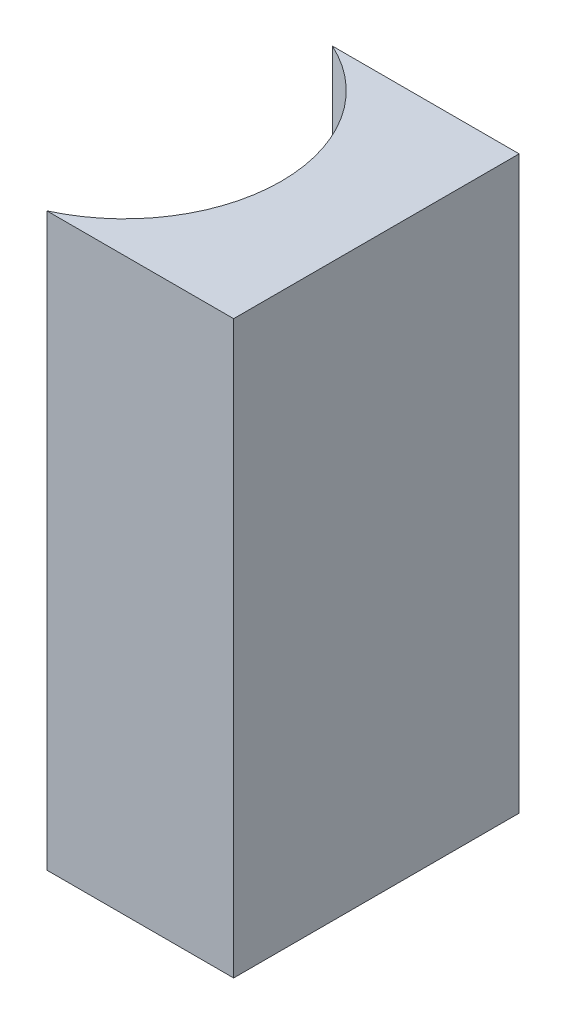
ISO-10303-21;
HEADER;
FILE_DESCRIPTION(('STEP AP214'),'2;1');
FILE_NAME('part.step','',(''),(''),'','','');
FILE_SCHEMA(('AUTOMOTIVE_DESIGN { 1 0 10303 214 1 1 1 1 }'));
ENDSEC;
DATA;
#1=APPLICATION_CONTEXT('core data for automotive mechanical design processes');
#2=APPLICATION_PROTOCOL_DEFINITION('international standard','automotive_design',2000,#1);
#3=PRODUCT_CONTEXT('',#1,'mechanical');
#4=PRODUCT('Part','Part','',(#3));
#5=PRODUCT_RELATED_PRODUCT_CATEGORY('part','',(#4));
#6=PRODUCT_DEFINITION_FORMATION('','',#4);
#7=PRODUCT_DEFINITION_CONTEXT('part definition',#1,'design');
#8=PRODUCT_DEFINITION('design','',#6,#7);
#9=PRODUCT_DEFINITION_SHAPE('','',#8);
#10=(LENGTH_UNIT() NAMED_UNIT(*) SI_UNIT(.MILLI.,.METRE.));
#11=(NAMED_UNIT(*) PLANE_ANGLE_UNIT() SI_UNIT($,.RADIAN.));
#12=(NAMED_UNIT(*) SI_UNIT($,.STERADIAN.) SOLID_ANGLE_UNIT());
#13=UNCERTAINTY_MEASURE_WITH_UNIT(LENGTH_MEASURE(1.E-05),#10,'distance_accuracy_value','');
#14=(GEOMETRIC_REPRESENTATION_CONTEXT(3) GLOBAL_UNCERTAINTY_ASSIGNED_CONTEXT((#13)) GLOBAL_UNIT_ASSIGNED_CONTEXT((#10,
#11,#12)) REPRESENTATION_CONTEXT('',''));
#15=CARTESIAN_POINT('',(0.,0.,0.));
#16=DIRECTION('',(0.,0.,1.));
#17=DIRECTION('',(1.,0.,0.));
#18=AXIS2_PLACEMENT_3D('',#15,#16,#17);
#19=CARTESIAN_POINT('',(0.,12.,0.));
#20=DIRECTION('',(0.,0.,1.));
#21=DIRECTION('',(1.,0.,0.));
#22=AXIS2_PLACEMENT_3D('',#19,#20,#21);
#23=PLANE('',#22);
#24=DIRECTION('',(-1.,0.,0.));
#25=VECTOR('',#24,1.);
#26=CARTESIAN_POINT('',(0.,0.,0.));
#27=LINE('',#26,#25);
#28=CARTESIAN_POINT('',(0.,0.,0.));
#29=VERTEX_POINT('',#28);
#30=CARTESIAN_POINT('',(-3.92522729151325,0.,0.));
#31=VERTEX_POINT('',#30);
#32=EDGE_CURVE('E109',#29,#31,#27,.T.);
#33=ORIENTED_EDGE('',*,*,#32,.T.);
#34=DIRECTION('',(0.,-1.,0.));
#35=VECTOR('',#34,1.);
#36=CARTESIAN_POINT('',(-3.92522729151325,12.,0.));
#37=LINE('',#36,#35);
#38=CARTESIAN_POINT('',(-3.92522729151325,12.,0.));
#39=VERTEX_POINT('',#38);
#40=EDGE_CURVE('E11',#39,#31,#37,.T.);
#41=ORIENTED_EDGE('',*,*,#40,.F.);
#42=DIRECTION('',(-1.,0.,0.));
#43=VECTOR('',#42,1.);
#44=CARTESIAN_POINT('',(0.,12.,0.));
#45=LINE('',#44,#43);
#46=CARTESIAN_POINT('',(0.,12.,0.));
#47=VERTEX_POINT('',#46);
#48=EDGE_CURVE('E91',#47,#39,#45,.T.);
#49=ORIENTED_EDGE('',*,*,#48,.F.);
#50=DIRECTION('',(0.,-1.,0.));
#51=VECTOR('',#50,1.);
#52=CARTESIAN_POINT('',(0.,12.,0.));
#53=LINE('',#52,#51);
#54=EDGE_CURVE('E105',#47,#29,#53,.T.);
#55=ORIENTED_EDGE('',*,*,#54,.T.);
#56=EDGE_LOOP('',(#33,#41,#49,#55));
#57=FACE_BOUND('',#56,.T.);
#58=ADVANCED_FACE('F39',(#57),#23,.F.);
#59=CARTESIAN_POINT('',(-5.3,12.,3.));
#60=DIRECTION('',(0.,-1.,0.));
#61=DIRECTION('',(0.,0.,-1.));
#62=AXIS2_PLACEMENT_3D('',#59,#60,#61);
#63=CYLINDRICAL_SURFACE('',#62,3.3);
#64=CARTESIAN_POINT('',(-5.3,0.,3.));
#65=DIRECTION('',(0.,-1.,0.));
#66=DIRECTION('',(0.,0.,1.));
#67=AXIS2_PLACEMENT_3D('',#64,#65,#66);
#68=CIRCLE('',#67,3.3);
#69=CARTESIAN_POINT('',(-3.92522729151325,0.,6.));
#70=VERTEX_POINT('',#69);
#71=EDGE_CURVE('E96',#31,#70,#68,.T.);
#72=ORIENTED_EDGE('',*,*,#71,.T.);
#73=DIRECTION('',(0.,-1.,0.));
#74=VECTOR('',#73,1.);
#75=CARTESIAN_POINT('',(-3.92522729151325,12.,6.));
#76=LINE('',#75,#74);
#77=CARTESIAN_POINT('',(-3.92522729151325,12.,6.));
#78=VERTEX_POINT('',#77);
#79=EDGE_CURVE('E48',#78,#70,#76,.T.);
#80=ORIENTED_EDGE('',*,*,#79,.F.);
#81=CARTESIAN_POINT('',(-5.3,12.,3.));
#82=DIRECTION('',(0.,-1.,0.));
#83=DIRECTION('',(0.,0.,1.));
#84=AXIS2_PLACEMENT_3D('',#81,#82,#83);
#85=CIRCLE('',#84,3.3);
#86=EDGE_CURVE('E86',#39,#78,#85,.T.);
#87=ORIENTED_EDGE('',*,*,#86,.F.);
#88=ORIENTED_EDGE('',*,*,#40,.T.);
#89=EDGE_LOOP('',(#72,#80,#87,#88));
#90=FACE_BOUND('',#89,.T.);
#91=ADVANCED_FACE('F95',(#90),#63,.F.);
#92=CARTESIAN_POINT('',(0.,12.,6.));
#93=DIRECTION('',(0.,0.,-1.));
#94=DIRECTION('',(-1.,0.,0.));
#95=AXIS2_PLACEMENT_3D('',#92,#93,#94);
#96=PLANE('',#95);
#97=DIRECTION('',(1.,0.,0.));
#98=VECTOR('',#97,1.);
#99=CARTESIAN_POINT('',(0.,0.,6.));
#100=LINE('',#99,#98);
#101=CARTESIAN_POINT('',(0.,0.,6.));
#102=VERTEX_POINT('',#101);
#103=EDGE_CURVE('E73',#70,#102,#100,.T.);
#104=ORIENTED_EDGE('',*,*,#103,.T.);
#105=DIRECTION('',(0.,-1.,0.));
#106=VECTOR('',#105,1.);
#107=CARTESIAN_POINT('',(0.,12.,6.));
#108=LINE('',#107,#106);
#109=CARTESIAN_POINT('',(0.,12.,6.));
#110=VERTEX_POINT('',#109);
#111=EDGE_CURVE('E98',#110,#102,#108,.T.);
#112=ORIENTED_EDGE('',*,*,#111,.F.);
#113=DIRECTION('',(1.,0.,0.));
#114=VECTOR('',#113,1.);
#115=CARTESIAN_POINT('',(0.,12.,6.));
#116=LINE('',#115,#114);
#117=EDGE_CURVE('E89',#78,#110,#116,.T.);
#118=ORIENTED_EDGE('',*,*,#117,.F.);
#119=ORIENTED_EDGE('',*,*,#79,.T.);
#120=EDGE_LOOP('',(#104,#112,#118,#119));
#121=FACE_BOUND('',#120,.T.);
#122=ADVANCED_FACE('F99',(#121),#96,.F.);
#123=CARTESIAN_POINT('',(0.,12.,0.));
#124=DIRECTION('',(-1.,0.,0.));
#125=DIRECTION('',(0.,0.,1.));
#126=AXIS2_PLACEMENT_3D('',#123,#124,#125);
#127=PLANE('',#126);
#128=DIRECTION('',(0.,0.,-1.));
#129=VECTOR('',#128,1.);
#130=CARTESIAN_POINT('',(0.,0.,0.));
#131=LINE('',#130,#129);
#132=EDGE_CURVE('E79',#102,#29,#131,.T.);
#133=ORIENTED_EDGE('',*,*,#132,.T.);
#134=ORIENTED_EDGE('',*,*,#54,.F.);
#135=DIRECTION('',(0.,0.,-1.));
#136=VECTOR('',#135,1.);
#137=CARTESIAN_POINT('',(0.,12.,0.));
#138=LINE('',#137,#136);
#139=EDGE_CURVE('E56',#110,#47,#138,.T.);
#140=ORIENTED_EDGE('',*,*,#139,.F.);
#141=ORIENTED_EDGE('',*,*,#111,.T.);
#142=EDGE_LOOP('',(#133,#134,#140,#141));
#143=FACE_BOUND('',#142,.T.);
#144=ADVANCED_FACE('F120',(#143),#127,.F.);
#145=CARTESIAN_POINT('',(-5.3,12.,3.));
#146=DIRECTION('',(0.,1.,0.));
#147=DIRECTION('',(0.,0.,1.));
#148=AXIS2_PLACEMENT_3D('',#145,#146,#147);
#149=PLANE('',#148);
#150=ORIENTED_EDGE('',*,*,#48,.T.);
#151=ORIENTED_EDGE('',*,*,#86,.T.);
#152=ORIENTED_EDGE('',*,*,#117,.T.);
#153=ORIENTED_EDGE('',*,*,#139,.T.);
#154=EDGE_LOOP('',(#150,#151,#152,#153));
#155=FACE_BOUND('',#154,.T.);
#156=ADVANCED_FACE('F87',(#155),#149,.T.);
#157=CARTESIAN_POINT('',(-5.3,0.,3.));
#158=DIRECTION('',(0.,1.,0.));
#159=DIRECTION('',(0.,0.,1.));
#160=AXIS2_PLACEMENT_3D('',#157,#158,#159);
#161=PLANE('',#160);
#162=ORIENTED_EDGE('',*,*,#32,.F.);
#163=ORIENTED_EDGE('',*,*,#132,.F.);
#164=ORIENTED_EDGE('',*,*,#103,.F.);
#165=ORIENTED_EDGE('',*,*,#71,.F.);
#166=EDGE_LOOP('',(#162,#163,#164,#165));
#167=FACE_BOUND('',#166,.T.);
#168=ADVANCED_FACE('F123',(#167),#161,.F.);
#169=CLOSED_SHELL('',(#58,#91,#122,#144,#156,#168));
#170=MANIFOLD_SOLID_BREP('B2',#169);
#171=ADVANCED_BREP_SHAPE_REPRESENTATION('',(#18,#170),#14);
#172=SHAPE_DEFINITION_REPRESENTATION(#9,#171);
ENDSEC;
END-ISO-10303-21;
